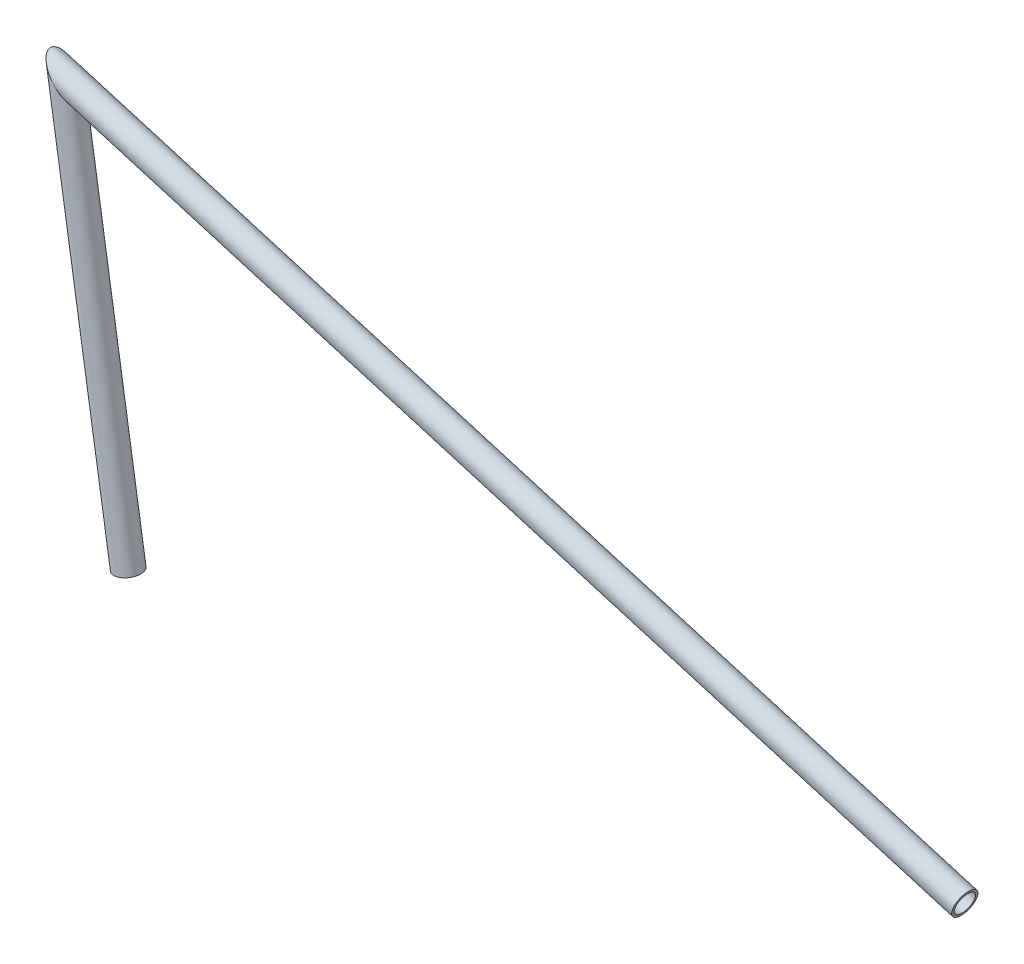
ISO-10303-21;
HEADER;
FILE_DESCRIPTION(('STEP AP214'),'2;1');
FILE_NAME('part.step','',(''),(''),'','','');
FILE_SCHEMA(('AUTOMOTIVE_DESIGN { 1 0 10303 214 1 1 1 1 }'));
ENDSEC;
DATA;
#1=APPLICATION_CONTEXT('core data for automotive mechanical design processes');
#2=APPLICATION_PROTOCOL_DEFINITION('international standard','automotive_design',2000,#1);
#3=PRODUCT_CONTEXT('',#1,'mechanical');
#4=PRODUCT('Part','Part','',(#3));
#5=PRODUCT_RELATED_PRODUCT_CATEGORY('part','',(#4));
#6=PRODUCT_DEFINITION_FORMATION('','',#4);
#7=PRODUCT_DEFINITION_CONTEXT('part definition',#1,'design');
#8=PRODUCT_DEFINITION('design','',#6,#7);
#9=PRODUCT_DEFINITION_SHAPE('','',#8);
#10=(LENGTH_UNIT() NAMED_UNIT(*) SI_UNIT(.MILLI.,.METRE.));
#11=(NAMED_UNIT(*) PLANE_ANGLE_UNIT() SI_UNIT($,.RADIAN.));
#12=(NAMED_UNIT(*) SI_UNIT($,.STERADIAN.) SOLID_ANGLE_UNIT());
#13=UNCERTAINTY_MEASURE_WITH_UNIT(LENGTH_MEASURE(1.E-05),#10,'distance_accuracy_value','');
#14=(GEOMETRIC_REPRESENTATION_CONTEXT(3) GLOBAL_UNCERTAINTY_ASSIGNED_CONTEXT((#13)) GLOBAL_UNIT_ASSIGNED_CONTEXT((#10,
#11,#12)) REPRESENTATION_CONTEXT('',''));
#15=CARTESIAN_POINT('',(0.,0.,0.));
#16=DIRECTION('',(0.,0.,1.));
#17=DIRECTION('',(1.,0.,0.));
#18=AXIS2_PLACEMENT_3D('',#15,#16,#17);
#19=CARTESIAN_POINT('',(0.,0.,0.));
#20=DIRECTION('',(0.155362260685432,-0.98785756460874,0.));
#21=DIRECTION('',(0.98785756460874,0.155362260685432,0.));
#22=AXIS2_PLACEMENT_3D('',#19,#20,#21);
#23=CYLINDRICAL_SURFACE('',#22,6.4643);
#24=CARTESIAN_POINT('',(38.8999999999979,-247.342302395328,0.));
#25=DIRECTION('',(-0.155362260685432,0.98785756460874,0.));
#26=DIRECTION('',(-0.98785756460874,-0.155362260685432,0.));
#27=AXIS2_PLACEMENT_3D('',#24,#25,#26);
#28=CIRCLE('',#27,6.4643);
#29=CARTESIAN_POINT('',(32.5141923450977,-248.346610657077,0.));
#30=VERTEX_POINT('',#29);
#31=EDGE_CURVE('E54',#30,#30,#28,.T.);
#32=ORIENTED_EDGE('',*,*,#31,.F.);
#33=EDGE_LOOP('',(#32));
#34=FACE_BOUND('',#33,.T.);
#35=CARTESIAN_POINT('',(0.,0.,0.));
#36=DIRECTION('',(0.752206581883343,0.658927354244288,0.));
#37=DIRECTION('',(0.658927354244288,-0.752206581883343,0.));
#38=AXIS2_PLACEMENT_3D('',#35,#36,#37);
#39=ELLIPSE('',#38,12.104028630937,6.4643);
#40=CARTESIAN_POINT('',(7.97567556148042,-9.10473000349524,0.));
#41=VERTEX_POINT('',#40);
#42=EDGE_CURVE('E50',#41,#41,#39,.T.);
#43=ORIENTED_EDGE('',*,*,#42,.T.);
#44=EDGE_LOOP('',(#43));
#45=FACE_BOUND('',#44,.T.);
#46=ADVANCED_FACE('F46',(#34,#45),#23,.F.);
#47=CARTESIAN_POINT('',(0.,0.,0.));
#48=DIRECTION('',(0.155362260685432,-0.98785756460874,0.));
#49=DIRECTION('',(0.98785756460874,0.155362260685432,0.));
#50=AXIS2_PLACEMENT_3D('',#47,#48,#49);
#51=CYLINDRICAL_SURFACE('',#50,7.9375);
#52=CARTESIAN_POINT('',(38.8999999999979,-247.342302395328,0.));
#53=DIRECTION('',(-0.155362260685432,0.98785756460874,0.));
#54=DIRECTION('',(-0.98785756460874,-0.155362260685432,0.));
#55=AXIS2_PLACEMENT_3D('',#52,#53,#54);
#56=CIRCLE('',#55,7.9375);
#57=CARTESIAN_POINT('',(31.0588805809161,-248.575490339518,0.));
#58=VERTEX_POINT('',#57);
#59=EDGE_CURVE('E58',#58,#58,#56,.T.);
#60=ORIENTED_EDGE('',*,*,#59,.T.);
#61=EDGE_LOOP('',(#60));
#62=FACE_BOUND('',#61,.T.);
#63=CARTESIAN_POINT('',(0.,0.,0.));
#64=DIRECTION('',(0.752206581883343,0.658927354244288,0.));
#65=DIRECTION('',(0.658927354244288,-0.752206581883343,0.));
#66=AXIS2_PLACEMENT_3D('',#63,#64,#65);
#67=ELLIPSE('',#66,14.8625105979089,7.9375);
#68=CARTESIAN_POINT('',(9.7933147857078,-11.179678295058,0.));
#69=VERTEX_POINT('',#68);
#70=EDGE_CURVE('E12',#69,#69,#67,.T.);
#71=ORIENTED_EDGE('',*,*,#70,.F.);
#72=EDGE_LOOP('',(#71));
#73=FACE_BOUND('',#72,.T.);
#74=ADVANCED_FACE('F73',(#62,#73),#51,.T.);
#75=CARTESIAN_POINT('',(38.8999999999979,-247.342302395328,0.));
#76=DIRECTION('',(-0.155362260685432,0.98785756460874,0.));
#77=DIRECTION('',(-0.98785756460874,-0.155362260685432,0.));
#78=AXIS2_PLACEMENT_3D('',#75,#76,#77);
#79=PLANE('',#78);
#80=ORIENTED_EDGE('',*,*,#31,.T.);
#81=EDGE_LOOP('',(#80));
#82=FACE_BOUND('',#81,.T.);
#83=ORIENTED_EDGE('',*,*,#59,.F.);
#84=EDGE_LOOP('',(#83));
#85=FACE_BOUND('',#84,.T.);
#86=ADVANCED_FACE('F69',(#82,#85),#79,.F.);
#87=CARTESIAN_POINT('',(0.,0.,0.));
#88=DIRECTION('',(0.752206581883343,0.658927354244288,0.));
#89=DIRECTION('',(-0.658927354244288,0.752206581883343,0.));
#90=AXIS2_PLACEMENT_3D('',#87,#88,#89);
#91=PLANE('',#90);
#92=ORIENTED_EDGE('',*,*,#42,.F.);
#93=EDGE_LOOP('',(#92));
#94=FACE_BOUND('',#93,.T.);
#95=ORIENTED_EDGE('',*,*,#70,.T.);
#96=EDGE_LOOP('',(#95));
#97=FACE_BOUND('',#96,.T.);
#98=ADVANCED_FACE('F48',(#94,#97),#91,.T.);
#99=CLOSED_SHELL('',(#46,#74,#86,#98));
#100=MANIFOLD_SOLID_BREP('B2',#99);
#101=CARTESIAN_POINT('',(562.77647421508,-166.718769942562,0.));
#102=DIRECTION('',(-0.958811947650041,0.284041632588492,0.));
#103=DIRECTION('',(-0.284041632588492,-0.958811947650041,0.));
#104=AXIS2_PLACEMENT_3D('',#101,#102,#103);
#105=CYLINDRICAL_SURFACE('',#104,6.4643);
#106=CARTESIAN_POINT('',(562.77647421508,-166.718769942562,0.));
#107=DIRECTION('',(0.958811947650041,-0.284041632588492,0.));
#108=DIRECTION('',(0.284041632588492,0.958811947650041,0.));
#109=AXIS2_PLACEMENT_3D('',#106,#107,#108);
#110=CIRCLE('',#109,6.4643);
#111=CARTESIAN_POINT('',(564.612604540621,-160.520721869368,0.));
#112=VERTEX_POINT('',#111);
#113=EDGE_CURVE('E142',#112,#112,#110,.T.);
#114=ORIENTED_EDGE('',*,*,#113,.T.);
#115=EDGE_LOOP('',(#114));
#116=FACE_BOUND('',#115,.T.);
#117=CARTESIAN_POINT('',(1.11022302462516E-13,0.,0.));
#118=DIRECTION('',(-0.752206581883343,-0.658927354244288,0.));
#119=DIRECTION('',(-0.658927354244288,0.752206581883343,0.));
#120=AXIS2_PLACEMENT_3D('',#117,#118,#119);
#121=ELLIPSE('',#120,12.104028630937,6.4643);
#122=CARTESIAN_POINT('',(-7.97567556148032,9.10473000349522,0.));
#123=VERTEX_POINT('',#122);
#124=EDGE_CURVE('E132',#123,#123,#121,.T.);
#125=ORIENTED_EDGE('',*,*,#124,.T.);
#126=EDGE_LOOP('',(#125));
#127=FACE_BOUND('',#126,.T.);
#128=ADVANCED_FACE('F128',(#116,#127),#105,.F.);
#129=CARTESIAN_POINT('',(562.77647421508,-166.718769942562,0.));
#130=DIRECTION('',(-0.958811947650041,0.284041632588492,0.));
#131=DIRECTION('',(-0.284041632588492,-0.958811947650041,0.));
#132=AXIS2_PLACEMENT_3D('',#129,#130,#131);
#133=CYLINDRICAL_SURFACE('',#132,7.9375);
#134=CARTESIAN_POINT('',(562.77647421508,-166.718769942562,0.));
#135=DIRECTION('',(0.958811947650041,-0.284041632588492,0.));
#136=DIRECTION('',(0.284041632588492,0.958811947650041,0.));
#137=AXIS2_PLACEMENT_3D('',#134,#135,#136);
#138=CIRCLE('',#137,7.9375);
#139=CARTESIAN_POINT('',(565.031054673751,-159.10820010809,0.));
#140=VERTEX_POINT('',#139);
#141=EDGE_CURVE('E136',#140,#140,#138,.T.);
#142=ORIENTED_EDGE('',*,*,#141,.F.);
#143=EDGE_LOOP('',(#142));
#144=FACE_BOUND('',#143,.T.);
#145=CARTESIAN_POINT('',(1.11022302462516E-13,0.,0.));
#146=DIRECTION('',(-0.752206581883343,-0.658927354244288,0.));
#147=DIRECTION('',(-0.658927354244288,0.752206581883343,0.));
#148=AXIS2_PLACEMENT_3D('',#145,#146,#147);
#149=ELLIPSE('',#148,14.8625105979089,7.9375);
#150=CARTESIAN_POINT('',(-9.79331478570769,11.179678295058,0.));
#151=VERTEX_POINT('',#150);
#152=EDGE_CURVE('E45',#151,#151,#149,.T.);
#153=ORIENTED_EDGE('',*,*,#152,.F.);
#154=EDGE_LOOP('',(#153));
#155=FACE_BOUND('',#154,.T.);
#156=ADVANCED_FACE('F155',(#144,#155),#133,.T.);
#157=CARTESIAN_POINT('',(562.77647421508,-166.718769942562,0.));
#158=DIRECTION('',(0.958811947650041,-0.284041632588492,0.));
#159=DIRECTION('',(0.284041632588492,0.958811947650041,0.));
#160=AXIS2_PLACEMENT_3D('',#157,#158,#159);
#161=PLANE('',#160);
#162=ORIENTED_EDGE('',*,*,#113,.F.);
#163=EDGE_LOOP('',(#162));
#164=FACE_BOUND('',#163,.T.);
#165=ORIENTED_EDGE('',*,*,#141,.T.);
#166=EDGE_LOOP('',(#165));
#167=FACE_BOUND('',#166,.T.);
#168=ADVANCED_FACE('F151',(#164,#167),#161,.T.);
#169=CARTESIAN_POINT('',(0.,0.,0.));
#170=DIRECTION('',(-0.752206581883343,-0.658927354244288,0.));
#171=DIRECTION('',(0.658927354244288,-0.752206581883343,0.));
#172=AXIS2_PLACEMENT_3D('',#169,#170,#171);
#173=PLANE('',#172);
#174=ORIENTED_EDGE('',*,*,#124,.F.);
#175=EDGE_LOOP('',(#174));
#176=FACE_BOUND('',#175,.T.);
#177=ORIENTED_EDGE('',*,*,#152,.T.);
#178=EDGE_LOOP('',(#177));
#179=FACE_BOUND('',#178,.T.);
#180=ADVANCED_FACE('F130',(#176,#179),#173,.T.);
#181=CLOSED_SHELL('',(#128,#156,#168,#180));
#182=MANIFOLD_SOLID_BREP('B7',#181);
#183=ADVANCED_BREP_SHAPE_REPRESENTATION('',(#18,#100,#182),#14);
#184=SHAPE_DEFINITION_REPRESENTATION(#9,#183);
ENDSEC;
END-ISO-10303-21;
